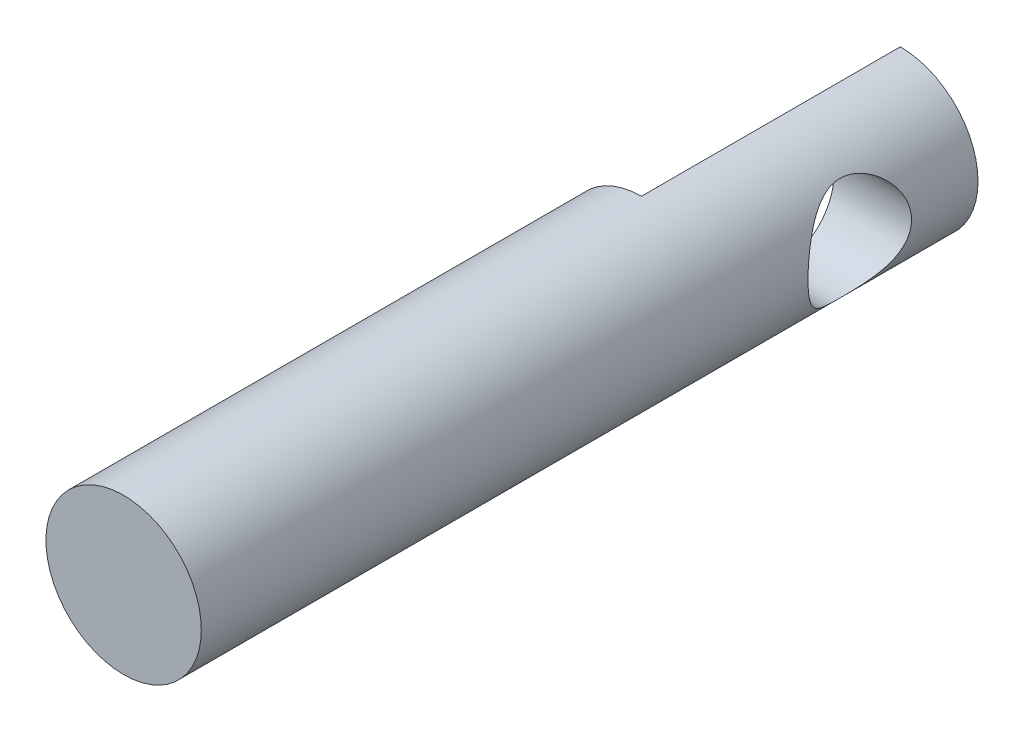
ISO-10303-21;
HEADER;
FILE_DESCRIPTION(('STEP AP214'),'2;1');
FILE_NAME('part.step','',(''),(''),'','','');
FILE_SCHEMA(('AUTOMOTIVE_DESIGN { 1 0 10303 214 1 1 1 1 }'));
ENDSEC;
DATA;
#1=APPLICATION_CONTEXT('core data for automotive mechanical design processes');
#2=APPLICATION_PROTOCOL_DEFINITION('international standard','automotive_design',2000,#1);
#3=PRODUCT_CONTEXT('',#1,'mechanical');
#4=PRODUCT('Part','Part','',(#3));
#5=PRODUCT_RELATED_PRODUCT_CATEGORY('part','',(#4));
#6=PRODUCT_DEFINITION_FORMATION('','',#4);
#7=PRODUCT_DEFINITION_CONTEXT('part definition',#1,'design');
#8=PRODUCT_DEFINITION('design','',#6,#7);
#9=PRODUCT_DEFINITION_SHAPE('','',#8);
#10=(LENGTH_UNIT() NAMED_UNIT(*) SI_UNIT(.MILLI.,.METRE.));
#11=(NAMED_UNIT(*) PLANE_ANGLE_UNIT() SI_UNIT($,.RADIAN.));
#12=(NAMED_UNIT(*) SI_UNIT($,.STERADIAN.) SOLID_ANGLE_UNIT());
#13=UNCERTAINTY_MEASURE_WITH_UNIT(LENGTH_MEASURE(1.E-05),#10,'distance_accuracy_value','');
#14=(GEOMETRIC_REPRESENTATION_CONTEXT(3) GLOBAL_UNCERTAINTY_ASSIGNED_CONTEXT((#13)) GLOBAL_UNIT_ASSIGNED_CONTEXT((#10,
#11,#12)) REPRESENTATION_CONTEXT('',''));
#15=CARTESIAN_POINT('',(0.,0.,0.));
#16=DIRECTION('',(0.,0.,1.));
#17=DIRECTION('',(1.,0.,0.));
#18=AXIS2_PLACEMENT_3D('',#15,#16,#17);
#19=CARTESIAN_POINT('',(0.,0.,15.));
#20=DIRECTION('',(0.,0.,-1.));
#21=DIRECTION('',(-1.,0.,0.));
#22=AXIS2_PLACEMENT_3D('',#19,#20,#21);
#23=CYLINDRICAL_SURFACE('',#22,1.5);
#24=CARTESIAN_POINT('',(1.5,0.,3.28254349130174));
#25=CARTESIAN_POINT('',(1.50000020822414,0.0502423583340641,3.28254376611798));
#26=CARTESIAN_POINT('',(1.49745401376693,0.100484543566457,3.27873650632399));
#27=CARTESIAN_POINT('',(1.48752326211906,0.199366529015834,3.2637450592489));
#28=CARTESIAN_POINT('',(1.48013640790618,0.248005556977501,3.25255736974009));
#29=CARTESIAN_POINT('',(1.46125241202354,0.342106153927126,3.22348963263932));
#30=CARTESIAN_POINT('',(1.44977452746657,0.387581436328778,3.20564092129777));
#31=CARTESIAN_POINT('',(1.4236306893872,0.474707645498629,3.16401180966599));
#32=CARTESIAN_POINT('',(1.40896427302755,0.516358015804834,3.14023054815146));
#33=CARTESIAN_POINT('',(1.37613664684919,0.598642350385054,3.08521502261802));
#34=CARTESIAN_POINT('',(1.3577844878966,0.638890152730338,3.05351956093029));
#35=CARTESIAN_POINT('',(1.31991156541733,0.713864022346369,2.98467846697251));
#36=CARTESIAN_POINT('',(1.30038915178416,0.748582027719439,2.94752502638287));
#37=CARTESIAN_POINT('',(1.25864132339397,0.81711148872748,2.8620173074954));
#38=CARTESIAN_POINT('',(1.23647533968899,0.849915931813755,2.81282066470002));
#39=CARTESIAN_POINT('',(1.19542073676408,0.906751785070868,2.70836180247847));
#40=CARTESIAN_POINT('',(1.17652647977327,0.930798367132494,2.65311029052035));
#41=CARTESIAN_POINT('',(1.14988133320735,0.963370175057203,2.55418784459094));
#42=CARTESIAN_POINT('',(1.14048813946218,0.974372236180082,2.51177926486483));
#43=CARTESIAN_POINT('',(1.12628984829786,0.9907530889261,2.42517123893087));
#44=CARTESIAN_POINT('',(1.12147684372013,0.996141573259661,2.38097501693855));
#45=CARTESIAN_POINT('',(1.11718302804083,1.00095682070629,2.29180610187366));
#46=CARTESIAN_POINT('',(1.11772401279478,1.0003592145882,2.24683097957614));
#47=CARTESIAN_POINT('',(1.12409887741485,0.993187906666195,2.15772600455126));
#48=CARTESIAN_POINT('',(1.12993724142592,0.986609141899784,2.11359690028542));
#49=CARTESIAN_POINT('',(1.14563592995791,0.968324971088712,2.02930996568295));
#50=CARTESIAN_POINT('',(1.15530744165153,0.956858557405004,1.98906282334021));
#51=CARTESIAN_POINT('',(1.17754811463845,0.929350592909502,1.91103164580599));
#52=CARTESIAN_POINT('',(1.19011822916388,0.913307536614355,1.87324842615311));
#53=CARTESIAN_POINT('',(1.21982098202212,0.873369093698319,1.7930307936606));
#54=CARTESIAN_POINT('',(1.23736158924507,0.848540261643843,1.75121354120768));
#55=CARTESIAN_POINT('',(1.27345768922483,0.79334480233653,1.67185179380983));
#56=CARTESIAN_POINT('',(1.29201441370946,0.762971345040339,1.63431266246461));
#57=CARTESIAN_POINT('',(1.33271671862095,0.689905826559712,1.55627221844617));
#58=CARTESIAN_POINT('',(1.35477372355024,0.6459696914045,1.51687646694604));
#59=CARTESIAN_POINT('',(1.39609050337856,0.551003999553811,1.4459452440468));
#60=CARTESIAN_POINT('',(1.41535288825285,0.499981149675165,1.41440241860069));
#61=CARTESIAN_POINT('',(1.44572702044166,0.402428913545602,1.36580463198753));
#62=CARTESIAN_POINT('',(1.45769630582498,0.356978821685243,1.34712180963153));
#63=CARTESIAN_POINT('',(1.47753859515521,0.263018021968456,1.31649102848979));
#64=CARTESIAN_POINT('',(1.48541506063844,0.21450993950102,1.30453737773583));
#65=CARTESIAN_POINT('',(1.49637941078331,0.115492726585949,1.28796290868254));
#66=CARTESIAN_POINT('',(1.49944661230576,0.0649759059670248,1.28337376083256));
#67=CARTESIAN_POINT('',(1.50041557482591,-0.0362207596946158,1.28191994702068));
#68=CARTESIAN_POINT('',(1.49831769692815,-0.0869005930932809,1.28505474105735));
#69=CARTESIAN_POINT('',(1.48949794712138,-0.183227858602146,1.29835551908272));
#70=CARTESIAN_POINT('',(1.48311123195135,-0.228978722339655,1.3080121401794));
#71=CARTESIAN_POINT('',(1.46659224642396,-0.31805819621364,1.33334133430811));
#72=CARTESIAN_POINT('',(1.45645937873408,-0.361386418785354,1.34901486676564));
#73=CARTESIAN_POINT('',(1.4324817626467,-0.447332375233221,1.38686963982441));
#74=CARTESIAN_POINT('',(1.41844935068245,-0.489748092316563,1.4093875683435));
#75=CARTESIAN_POINT('',(1.38800927805403,-0.570341511977789,1.45976013627404));
#76=CARTESIAN_POINT('',(1.37160015200651,-0.608516574097254,1.4876180715647));
#77=CARTESIAN_POINT('',(1.33477273328243,-0.685927227415322,1.5528474253841));
#78=CARTESIAN_POINT('',(1.31413078406203,-0.724375937862664,1.59102662135376));
#79=CARTESIAN_POINT('',(1.27285586536854,-0.794669840332392,1.67309920626581));
#80=CARTESIAN_POINT('',(1.25222291185946,-0.826510468230433,1.71699651080113));
#81=CARTESIAN_POINT('',(1.21469839506517,-0.880623882794763,1.80611469773094));
#82=CARTESIAN_POINT('',(1.19763798588661,-0.903478180804394,1.85090950820159));
#83=CARTESIAN_POINT('',(1.16719487207113,-0.942481068876251,1.94447981769231));
#84=CARTESIAN_POINT('',(1.1538055628277,-0.958641728453858,1.99324796049943));
#85=CARTESIAN_POINT('',(1.13466604076532,-0.981179217293119,2.08482573486878));
#86=CARTESIAN_POINT('',(1.12797499006895,-0.988792987823092,2.12712939623121));
#87=CARTESIAN_POINT('',(1.11939733222928,-0.998496029624888,2.21283013196945));
#88=CARTESIAN_POINT('',(1.11750550674066,-1.00059130142516,2.25622596687497));
#89=CARTESIAN_POINT('',(1.11882100574833,-0.999119609907757,2.3428650196601));
#90=CARTESIAN_POINT('',(1.12203134956833,-0.995549293852657,2.38610813198319));
#91=CARTESIAN_POINT('',(1.13305226198639,-0.982984986109972,2.47121525557322));
#92=CARTESIAN_POINT('',(1.14086896751217,-0.973983758587651,2.51307734823212));
#93=CARTESIAN_POINT('',(1.1626342196827,-0.947965178356309,2.60539908451605));
#94=CARTESIAN_POINT('',(1.17766166854602,-0.929450935941995,2.65517734767127));
#95=CARTESIAN_POINT('',(1.21111080629161,-0.885422631474875,2.75028690839114));
#96=CARTESIAN_POINT('',(1.22953724861882,-0.859898741785422,2.79561184027016));
#97=CARTESIAN_POINT('',(1.26808593269725,-0.801991402694659,2.88218443489857));
#98=CARTESIAN_POINT('',(1.2882329369107,-0.769491549448274,2.92334286402099));
#99=CARTESIAN_POINT('',(1.32814150773993,-0.698358840177311,3.00020473042297));
#100=CARTESIAN_POINT('',(1.3479029541764,-0.659724105134954,3.03590648981414));
#101=CARTESIAN_POINT('',(1.38815775980392,-0.570728664877772,3.10589954345879));
#102=CARTESIAN_POINT('',(1.40834902724558,-0.51948083477599,3.13925281139156));
#103=CARTESIAN_POINT('',(1.44388832937518,-0.410434277887492,3.19650012963372));
#104=CARTESIAN_POINT('',(1.45924396722731,-0.352646031225025,3.22040904471355));
#105=CARTESIAN_POINT('',(1.48050822418367,-0.245717534917528,3.25312078038375));
#106=CARTESIAN_POINT('',(1.48775740184446,-0.197506162628869,3.26409901085108));
#107=CARTESIAN_POINT('',(1.49750140070948,-0.0995290060120662,3.27880750757075));
#108=CARTESIAN_POINT('',(1.49999979375663,-0.0497644180940291,3.28254321909973));
#109=CARTESIAN_POINT('',(1.5,0.,3.28254349130174));
#110=B_SPLINE_CURVE_WITH_KNOTS('',3,(#24,#25,#26,#27,#28,#29,#30,#31,#32,#33,#34,#35,#36,#37,
#38,#39,#40,#41,#42,#43,#44,#45,#46,#47,#48,#49,#50,#51,#52,#53,#54,#55,#56,#57,#58,#59,#60,#61,
#62,#63,#64,#65,#66,#67,#68,#69,#70,#71,#72,#73,#74,#75,#76,#77,#78,#79,#80,#81,#82,#83,#84,#85,
#86,#87,#88,#89,#90,#91,#92,#93,#94,#95,#96,#97,#98,#99,#100,#101,#102,#103,#104,#105,#106,#107,
#108,#109),.UNSPECIFIED.,.T.,.F.,(4,2,2,2,2,2,2,2,2,2,2,2,2,2,2,2,2,2,2,2,2,2,2,2,2,2,2,2,2,2,2,
2,2,2,2,2,2,2,2,2,2,2,4),(0.,0.1505266132527,0.301124707174344,0.451023076595116,
0.600943219336932,0.763585145002783,0.926462058021593,1.11503341647991,1.30327652722719,
1.43716846838015,1.57082883922904,1.70503355867689,1.83935198631676,1.96774431099011,
2.09617891902539,2.25073787329797,2.40548851889212,2.5935947724756,2.78152420149865,
2.93262043847563,3.08358867570591,3.23520441646309,3.38680955765891,3.5277654239542,
3.66874377568319,3.81826173413942,3.96787227471786,4.1411408806983,4.31452876587063,
4.47324967649701,4.63168313315306,4.76162024003012,4.8914160016149,5.02128860137218,
5.15133461921144,5.31603304346011,5.48096356682587,5.64889622595852,5.81688041978686,
6.00897675773024,6.20076953274023,6.34997645676983,6.49907115623394),.UNSPECIFIED.);
#111=CARTESIAN_POINT('',(1.5,0.,3.28254349130174));
#112=VERTEX_POINT('',#111);
#113=EDGE_CURVE('E64',#112,#112,#110,.T.);
#114=ORIENTED_EDGE('',*,*,#113,.T.);
#115=EDGE_LOOP('',(#114));
#116=FACE_BOUND('',#115,.T.);
#117=CARTESIAN_POINT('',(0.,0.,15.));
#118=DIRECTION('',(0.,0.,1.));
#119=DIRECTION('',(1.,0.,0.));
#120=AXIS2_PLACEMENT_3D('',#117,#118,#119);
#121=CIRCLE('',#120,1.5);
#122=CARTESIAN_POINT('',(1.5,0.,15.));
#123=VERTEX_POINT('',#122);
#124=EDGE_CURVE('E73',#123,#123,#121,.T.);
#125=ORIENTED_EDGE('',*,*,#124,.F.);
#126=EDGE_LOOP('',(#125));
#127=FACE_BOUND('',#126,.T.);
#128=CARTESIAN_POINT('',(0.,0.,5.));
#129=DIRECTION('',(0.,0.,1.));
#130=DIRECTION('',(0.,-1.,0.));
#131=AXIS2_PLACEMENT_3D('',#128,#129,#130);
#132=CIRCLE('',#131,1.5);
#133=CARTESIAN_POINT('',(0.,1.5,5.));
#134=VERTEX_POINT('',#133);
#135=CARTESIAN_POINT('',(0.,-1.5,5.));
#136=VERTEX_POINT('',#135);
#137=EDGE_CURVE('E11',#134,#136,#132,.T.);
#138=ORIENTED_EDGE('',*,*,#137,.T.);
#139=DIRECTION('',(0.,0.,-1.));
#140=VECTOR('',#139,1.);
#141=CARTESIAN_POINT('',(0.,-1.5,15.));
#142=LINE('',#141,#140);
#143=CARTESIAN_POINT('',(0.,-1.5,0.));
#144=VERTEX_POINT('',#143);
#145=EDGE_CURVE('E63',#136,#144,#142,.T.);
#146=ORIENTED_EDGE('',*,*,#145,.T.);
#147=CARTESIAN_POINT('',(0.,0.,0.));
#148=DIRECTION('',(0.,0.,1.));
#149=DIRECTION('',(1.,0.,0.));
#150=AXIS2_PLACEMENT_3D('',#147,#148,#149);
#151=CIRCLE('',#150,1.5);
#152=CARTESIAN_POINT('',(0.,1.5,0.));
#153=VERTEX_POINT('',#152);
#154=EDGE_CURVE('E68',#144,#153,#151,.T.);
#155=ORIENTED_EDGE('',*,*,#154,.T.);
#156=DIRECTION('',(0.,0.,-1.));
#157=VECTOR('',#156,1.);
#158=CARTESIAN_POINT('',(0.,1.5,15.));
#159=LINE('',#158,#157);
#160=EDGE_CURVE('E48',#153,#134,#159,.F.);
#161=ORIENTED_EDGE('',*,*,#160,.T.);
#162=EDGE_LOOP('',(#138,#146,#155,#161));
#163=FACE_BOUND('',#162,.T.);
#164=ADVANCED_FACE('F33',(#116,#127,#163),#23,.T.);
#165=CARTESIAN_POINT('',(0.,0.,15.));
#166=DIRECTION('',(0.,0.,1.));
#167=DIRECTION('',(1.,0.,0.));
#168=AXIS2_PLACEMENT_3D('',#165,#166,#167);
#169=PLANE('',#168);
#170=ORIENTED_EDGE('',*,*,#124,.T.);
#171=EDGE_LOOP('',(#170));
#172=FACE_BOUND('',#171,.T.);
#173=ADVANCED_FACE('F79',(#172),#169,.T.);
#174=CARTESIAN_POINT('',(0.,0.,0.));
#175=DIRECTION('',(0.,0.,1.));
#176=DIRECTION('',(1.,0.,0.));
#177=AXIS2_PLACEMENT_3D('',#174,#175,#176);
#178=PLANE('',#177);
#179=ORIENTED_EDGE('',*,*,#154,.F.);
#180=DIRECTION('',(0.,1.,0.));
#181=VECTOR('',#180,1.);
#182=CARTESIAN_POINT('',(0.,0.,0.));
#183=LINE('',#182,#181);
#184=EDGE_CURVE('E41',#144,#153,#183,.T.);
#185=ORIENTED_EDGE('',*,*,#184,.T.);
#186=EDGE_LOOP('',(#179,#185));
#187=FACE_BOUND('',#186,.T.);
#188=ADVANCED_FACE('F77',(#187),#178,.F.);
#189=CARTESIAN_POINT('',(-30.,2.30642546482836,5.));
#190=DIRECTION('',(0.,0.,1.));
#191=DIRECTION('',(0.,-1.,0.));
#192=AXIS2_PLACEMENT_3D('',#189,#190,#191);
#193=PLANE('',#192);
#194=DIRECTION('',(0.,-1.,0.));
#195=VECTOR('',#194,1.);
#196=CARTESIAN_POINT('',(0.,2.30642546482836,5.));
#197=LINE('',#196,#195);
#198=EDGE_CURVE('E60',#134,#136,#197,.T.);
#199=ORIENTED_EDGE('',*,*,#198,.T.);
#200=ORIENTED_EDGE('',*,*,#137,.F.);
#201=EDGE_LOOP('',(#199,#200));
#202=FACE_BOUND('',#201,.T.);
#203=ADVANCED_FACE('F59',(#202),#193,.F.);
#204=CARTESIAN_POINT('',(0.,0.,0.));
#205=DIRECTION('',(1.,0.,0.));
#206=DIRECTION('',(0.,0.,-1.));
#207=AXIS2_PLACEMENT_3D('',#204,#205,#206);
#208=PLANE('',#207);
#209=CARTESIAN_POINT('',(0.,0.,2.28254349130174));
#210=DIRECTION('',(-1.,0.,0.));
#211=DIRECTION('',(0.,0.,1.));
#212=AXIS2_PLACEMENT_3D('',#209,#210,#211);
#213=CIRCLE('',#212,1.);
#214=CARTESIAN_POINT('',(0.,0.,3.28254349130174));
#215=VERTEX_POINT('',#214);
#216=EDGE_CURVE('E96',#215,#215,#213,.T.);
#217=ORIENTED_EDGE('',*,*,#216,.F.);
#218=EDGE_LOOP('',(#217));
#219=FACE_BOUND('',#218,.T.);
#220=ORIENTED_EDGE('',*,*,#198,.F.);
#221=ORIENTED_EDGE('',*,*,#160,.F.);
#222=ORIENTED_EDGE('',*,*,#184,.F.);
#223=ORIENTED_EDGE('',*,*,#145,.F.);
#224=EDGE_LOOP('',(#220,#221,#222,#223));
#225=FACE_BOUND('',#224,.T.);
#226=ADVANCED_FACE('F62',(#219,#225),#208,.F.);
#227=CARTESIAN_POINT('',(30.,0.,2.28254349130174));
#228=DIRECTION('',(-1.,0.,0.));
#229=DIRECTION('',(0.,0.,1.));
#230=AXIS2_PLACEMENT_3D('',#227,#228,#229);
#231=CYLINDRICAL_SURFACE('',#230,1.);
#232=ORIENTED_EDGE('',*,*,#216,.T.);
#233=EDGE_LOOP('',(#232));
#234=FACE_BOUND('',#233,.T.);
#235=ORIENTED_EDGE('',*,*,#113,.F.);
#236=EDGE_LOOP('',(#235));
#237=FACE_BOUND('',#236,.T.);
#238=ADVANCED_FACE('F103',(#234,#237),#231,.F.);
#239=CLOSED_SHELL('',(#164,#173,#188,#203,#226,#238));
#240=MANIFOLD_SOLID_BREP('B2',#239);
#241=ADVANCED_BREP_SHAPE_REPRESENTATION('',(#18,#240),#14);
#242=SHAPE_DEFINITION_REPRESENTATION(#9,#241);
ENDSEC;
END-ISO-10303-21;
